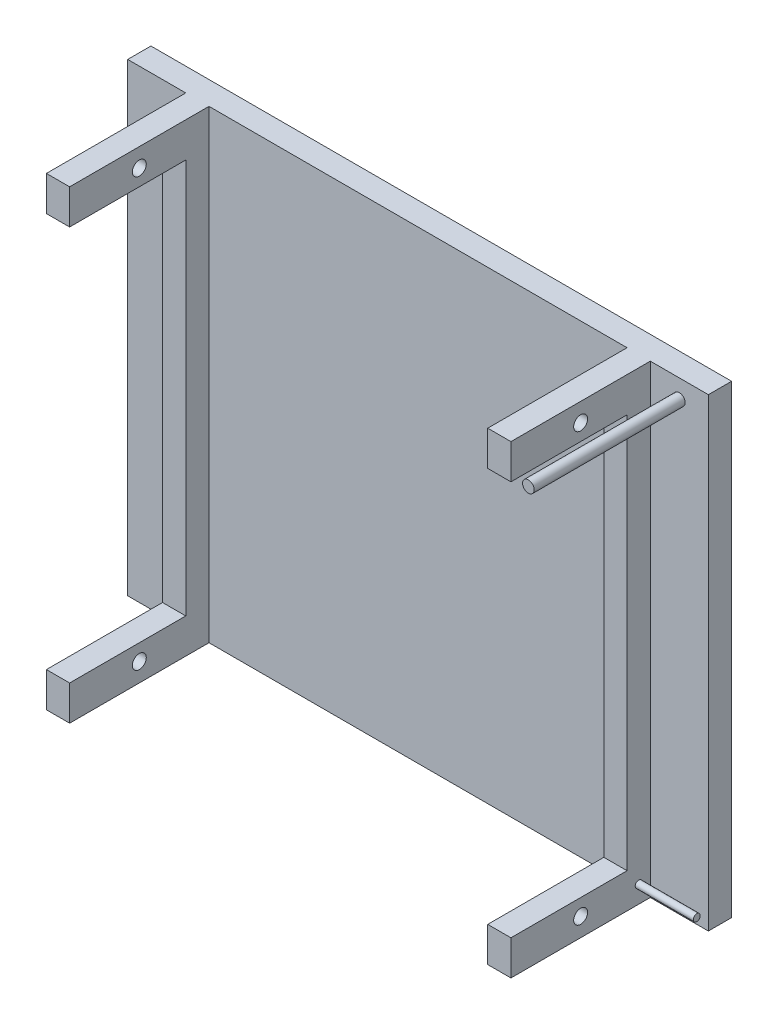
ISO-10303-21;
HEADER;
FILE_DESCRIPTION(('STEP AP214'),'2;1');
FILE_NAME('part.step','',(''),(''),'','','');
FILE_SCHEMA(('AUTOMOTIVE_DESIGN { 1 0 10303 214 1 1 1 1 }'));
ENDSEC;
DATA;
#1=APPLICATION_CONTEXT('core data for automotive mechanical design processes');
#2=APPLICATION_PROTOCOL_DEFINITION('international standard','automotive_design',2000,#1);
#3=PRODUCT_CONTEXT('',#1,'mechanical');
#4=PRODUCT('Part','Part','',(#3));
#5=PRODUCT_RELATED_PRODUCT_CATEGORY('part','',(#4));
#6=PRODUCT_DEFINITION_FORMATION('','',#4);
#7=PRODUCT_DEFINITION_CONTEXT('part definition',#1,'design');
#8=PRODUCT_DEFINITION('design','',#6,#7);
#9=PRODUCT_DEFINITION_SHAPE('','',#8);
#10=(LENGTH_UNIT() NAMED_UNIT(*) SI_UNIT(.MILLI.,.METRE.));
#11=(NAMED_UNIT(*) PLANE_ANGLE_UNIT() SI_UNIT($,.RADIAN.));
#12=(NAMED_UNIT(*) SI_UNIT($,.STERADIAN.) SOLID_ANGLE_UNIT());
#13=UNCERTAINTY_MEASURE_WITH_UNIT(LENGTH_MEASURE(1.E-05),#10,'distance_accuracy_value','');
#14=(GEOMETRIC_REPRESENTATION_CONTEXT(3) GLOBAL_UNCERTAINTY_ASSIGNED_CONTEXT((#13)) GLOBAL_UNIT_ASSIGNED_CONTEXT((#10,
#11,#12)) REPRESENTATION_CONTEXT('',''));
#15=CARTESIAN_POINT('',(0.,0.,0.));
#16=DIRECTION('',(0.,0.,1.));
#17=DIRECTION('',(1.,0.,0.));
#18=AXIS2_PLACEMENT_3D('',#15,#16,#17);
#19=CARTESIAN_POINT('',(0.,0.,70.));
#20=DIRECTION('',(0.,0.,1.));
#21=DIRECTION('',(1.,0.,0.));
#22=AXIS2_PLACEMENT_3D('',#19,#20,#21);
#23=PLANE('',#22);
#24=DIRECTION('',(1.,0.,0.));
#25=VECTOR('',#24,1.);
#26=CARTESIAN_POINT('',(0.,-14.9999999999999,70.));
#27=LINE('',#26,#25);
#28=CARTESIAN_POINT('',(25.,-14.9999999999999,70.));
#29=VERTEX_POINT('',#28);
#30=CARTESIAN_POINT('',(35.,-14.9999999999999,70.));
#31=VERTEX_POINT('',#30);
#32=EDGE_CURVE('E335',#29,#31,#27,.T.);
#33=ORIENTED_EDGE('',*,*,#32,.T.);
#34=DIRECTION('',(0.,1.,0.));
#35=VECTOR('',#34,1.);
#36=CARTESIAN_POINT('',(35.,0.,70.));
#37=LINE('',#36,#35);
#38=CARTESIAN_POINT('',(35.,0.,70.));
#39=VERTEX_POINT('',#38);
#40=EDGE_CURVE('E238',#31,#39,#37,.T.);
#41=ORIENTED_EDGE('',*,*,#40,.T.);
#42=DIRECTION('',(-1.,0.,0.));
#43=VECTOR('',#42,1.);
#44=CARTESIAN_POINT('',(25.,0.,70.));
#45=LINE('',#44,#43);
#46=CARTESIAN_POINT('',(25.,0.,70.));
#47=VERTEX_POINT('',#46);
#48=EDGE_CURVE('E242',#39,#47,#45,.T.);
#49=ORIENTED_EDGE('',*,*,#48,.T.);
#50=DIRECTION('',(0.,-1.,0.));
#51=VECTOR('',#50,1.);
#52=CARTESIAN_POINT('',(25.,0.,70.));
#53=LINE('',#52,#51);
#54=EDGE_CURVE('E232',#47,#29,#53,.T.);
#55=ORIENTED_EDGE('',*,*,#54,.T.);
#56=EDGE_LOOP('',(#33,#41,#49,#55));
#57=FACE_BOUND('',#56,.T.);
#58=ADVANCED_FACE('F38',(#57),#23,.T.);
#59=CARTESIAN_POINT('',(0.,0.,70.));
#60=DIRECTION('',(0.,0.,-1.));
#61=DIRECTION('',(-1.,0.,0.));
#62=AXIS2_PLACEMENT_3D('',#59,#60,#61);
#63=PLANE('',#62);
#64=DIRECTION('',(0.,-1.,0.));
#65=VECTOR('',#64,1.);
#66=CARTESIAN_POINT('',(215.,0.,70.));
#67=LINE('',#66,#65);
#68=CARTESIAN_POINT('',(215.,0.,70.));
#69=VERTEX_POINT('',#68);
#70=CARTESIAN_POINT('',(215.,-14.9999999999999,70.));
#71=VERTEX_POINT('',#70);
#72=EDGE_CURVE('E211',#69,#71,#67,.T.);
#73=ORIENTED_EDGE('',*,*,#72,.T.);
#74=DIRECTION('',(1.,0.,0.));
#75=VECTOR('',#74,1.);
#76=CARTESIAN_POINT('',(0.,-14.9999999999999,70.));
#77=LINE('',#76,#75);
#78=CARTESIAN_POINT('',(225.,-14.9999999999999,70.));
#79=VERTEX_POINT('',#78);
#80=EDGE_CURVE('E183',#71,#79,#77,.T.);
#81=ORIENTED_EDGE('',*,*,#80,.T.);
#82=DIRECTION('',(0.,1.,0.));
#83=VECTOR('',#82,1.);
#84=CARTESIAN_POINT('',(225.,0.,70.));
#85=LINE('',#84,#83);
#86=CARTESIAN_POINT('',(225.,0.,70.));
#87=VERTEX_POINT('',#86);
#88=EDGE_CURVE('E202',#79,#87,#85,.T.);
#89=ORIENTED_EDGE('',*,*,#88,.T.);
#90=DIRECTION('',(-1.,0.,0.));
#91=VECTOR('',#90,1.);
#92=CARTESIAN_POINT('',(225.,0.,70.));
#93=LINE('',#92,#91);
#94=EDGE_CURVE('E201',#87,#69,#93,.T.);
#95=ORIENTED_EDGE('',*,*,#94,.T.);
#96=EDGE_LOOP('',(#73,#81,#89,#95));
#97=FACE_BOUND('',#96,.T.);
#98=ADVANCED_FACE('F400',(#97),#63,.F.);
#99=CARTESIAN_POINT('',(0.,0.,10.));
#100=DIRECTION('',(0.,0.,1.));
#101=DIRECTION('',(1.,0.,0.));
#102=AXIS2_PLACEMENT_3D('',#99,#100,#101);
#103=PLANE('',#102);
#104=CARTESIAN_POINT('',(237.5,-8.00000000000001,10.));
#105=DIRECTION('',(0.,0.,1.));
#106=DIRECTION('',(1.,0.,0.));
#107=AXIS2_PLACEMENT_3D('',#104,#105,#106);
#108=CIRCLE('',#107,2.5);
#109=CARTESIAN_POINT('',(240.,-8.00000000000001,10.));
#110=VERTEX_POINT('',#109);
#111=EDGE_CURVE('E355',#110,#110,#108,.T.);
#112=ORIENTED_EDGE('',*,*,#111,.F.);
#113=EDGE_LOOP('',(#112));
#114=FACE_BOUND('',#113,.T.);
#115=DIRECTION('',(-1.,0.,0.));
#116=VECTOR('',#115,1.);
#117=CARTESIAN_POINT('',(0.,0.,10.));
#118=LINE('',#117,#116);
#119=CARTESIAN_POINT('',(250.,0.,10.));
#120=VERTEX_POINT('',#119);
#121=CARTESIAN_POINT('',(225.,0.,10.));
#122=VERTEX_POINT('',#121);
#123=EDGE_CURVE('E273',#120,#122,#118,.T.);
#124=ORIENTED_EDGE('',*,*,#123,.T.);
#125=DIRECTION('',(0.,1.,0.));
#126=VECTOR('',#125,1.);
#127=CARTESIAN_POINT('',(225.,0.,10.));
#128=LINE('',#127,#126);
#129=CARTESIAN_POINT('',(225.,-200.,10.));
#130=VERTEX_POINT('',#129);
#131=EDGE_CURVE('E216',#130,#122,#128,.T.);
#132=ORIENTED_EDGE('',*,*,#131,.F.);
#133=DIRECTION('',(1.,0.,0.));
#134=VECTOR('',#133,1.);
#135=CARTESIAN_POINT('',(0.,-200.,10.));
#136=LINE('',#135,#134);
#137=CARTESIAN_POINT('',(250.,-200.,10.));
#138=VERTEX_POINT('',#137);
#139=EDGE_CURVE('E265',#130,#138,#136,.T.);
#140=ORIENTED_EDGE('',*,*,#139,.T.);
#141=DIRECTION('',(0.,1.,0.));
#142=VECTOR('',#141,1.);
#143=CARTESIAN_POINT('',(250.,0.,10.));
#144=LINE('',#143,#142);
#145=EDGE_CURVE('E269',#138,#120,#144,.T.);
#146=ORIENTED_EDGE('',*,*,#145,.T.);
#147=EDGE_LOOP('',(#124,#132,#140,#146));
#148=FACE_BOUND('',#147,.T.);
#149=ADVANCED_FACE('F418',(#114,#148),#103,.T.);
#150=CARTESIAN_POINT('',(35.,-200.,10.));
#151=VERTEX_POINT('',#150);
#152=CARTESIAN_POINT('',(215.,-200.,10.));
#153=VERTEX_POINT('',#152);
#154=EDGE_CURVE('E270',#151,#153,#136,.T.);
#155=ORIENTED_EDGE('',*,*,#154,.T.);
#156=DIRECTION('',(0.,-1.,0.));
#157=VECTOR('',#156,1.);
#158=CARTESIAN_POINT('',(215.,0.,10.));
#159=LINE('',#158,#157);
#160=CARTESIAN_POINT('',(215.,0.,10.));
#161=VERTEX_POINT('',#160);
#162=EDGE_CURVE('E206',#161,#153,#159,.T.);
#163=ORIENTED_EDGE('',*,*,#162,.F.);
#164=CARTESIAN_POINT('',(35.,0.,10.));
#165=VERTEX_POINT('',#164);
#166=EDGE_CURVE('E276',#161,#165,#118,.T.);
#167=ORIENTED_EDGE('',*,*,#166,.T.);
#168=DIRECTION('',(0.,1.,0.));
#169=VECTOR('',#168,1.);
#170=CARTESIAN_POINT('',(35.,0.,10.));
#171=LINE('',#170,#169);
#172=EDGE_CURVE('E247',#151,#165,#171,.T.);
#173=ORIENTED_EDGE('',*,*,#172,.F.);
#174=EDGE_LOOP('',(#155,#163,#167,#173));
#175=FACE_BOUND('',#174,.T.);
#176=ADVANCED_FACE('F445',(#175),#103,.T.);
#177=DIRECTION('',(0.,-1.,0.));
#178=VECTOR('',#177,1.);
#179=CARTESIAN_POINT('',(25.,0.,10.));
#180=LINE('',#179,#178);
#181=CARTESIAN_POINT('',(25.,0.,10.));
#182=VERTEX_POINT('',#181);
#183=CARTESIAN_POINT('',(25.,-200.,10.));
#184=VERTEX_POINT('',#183);
#185=EDGE_CURVE('E231',#182,#184,#180,.T.);
#186=ORIENTED_EDGE('',*,*,#185,.F.);
#187=CARTESIAN_POINT('',(0.,0.,10.));
#188=VERTEX_POINT('',#187);
#189=EDGE_CURVE('E272',#182,#188,#118,.T.);
#190=ORIENTED_EDGE('',*,*,#189,.T.);
#191=DIRECTION('',(0.,-1.,0.));
#192=VECTOR('',#191,1.);
#193=CARTESIAN_POINT('',(0.,0.,10.));
#194=LINE('',#193,#192);
#195=CARTESIAN_POINT('',(0.,-200.,10.));
#196=VERTEX_POINT('',#195);
#197=EDGE_CURVE('E262',#188,#196,#194,.T.);
#198=ORIENTED_EDGE('',*,*,#197,.T.);
#199=EDGE_CURVE('E267',#196,#184,#136,.T.);
#200=ORIENTED_EDGE('',*,*,#199,.T.);
#201=EDGE_LOOP('',(#186,#190,#198,#200));
#202=FACE_BOUND('',#201,.T.);
#203=ADVANCED_FACE('F447',(#202),#103,.T.);
#204=CARTESIAN_POINT('',(0.,0.,10.));
#205=DIRECTION('',(1.,0.,0.));
#206=DIRECTION('',(0.,1.,0.));
#207=AXIS2_PLACEMENT_3D('',#204,#205,#206);
#208=PLANE('',#207);
#209=DIRECTION('',(0.,-1.,0.));
#210=VECTOR('',#209,1.);
#211=CARTESIAN_POINT('',(0.,0.,0.));
#212=LINE('',#211,#210);
#213=CARTESIAN_POINT('',(0.,0.,0.));
#214=VERTEX_POINT('',#213);
#215=CARTESIAN_POINT('',(0.,-200.,0.));
#216=VERTEX_POINT('',#215);
#217=EDGE_CURVE('E261',#214,#216,#212,.T.);
#218=ORIENTED_EDGE('',*,*,#217,.T.);
#219=DIRECTION('',(0.,0.,-1.));
#220=VECTOR('',#219,1.);
#221=CARTESIAN_POINT('',(0.,-200.,10.));
#222=LINE('',#221,#220);
#223=EDGE_CURVE('E184',#196,#216,#222,.T.);
#224=ORIENTED_EDGE('',*,*,#223,.F.);
#225=ORIENTED_EDGE('',*,*,#197,.F.);
#226=DIRECTION('',(0.,0.,-1.));
#227=VECTOR('',#226,1.);
#228=CARTESIAN_POINT('',(0.,0.,10.));
#229=LINE('',#228,#227);
#230=EDGE_CURVE('E275',#188,#214,#229,.T.);
#231=ORIENTED_EDGE('',*,*,#230,.T.);
#232=EDGE_LOOP('',(#218,#224,#225,#231));
#233=FACE_BOUND('',#232,.T.);
#234=ADVANCED_FACE('F40',(#233),#208,.F.);
#235=CARTESIAN_POINT('',(0.,-200.,10.));
#236=DIRECTION('',(0.,1.,0.));
#237=DIRECTION('',(0.,0.,1.));
#238=AXIS2_PLACEMENT_3D('',#235,#236,#237);
#239=PLANE('',#238);
#240=DIRECTION('',(1.,0.,0.));
#241=VECTOR('',#240,1.);
#242=CARTESIAN_POINT('',(0.,-200.,0.));
#243=LINE('',#242,#241);
#244=CARTESIAN_POINT('',(250.,-200.,0.));
#245=VERTEX_POINT('',#244);
#246=EDGE_CURVE('E279',#216,#245,#243,.T.);
#247=ORIENTED_EDGE('',*,*,#246,.T.);
#248=DIRECTION('',(0.,0.,-1.));
#249=VECTOR('',#248,1.);
#250=CARTESIAN_POINT('',(250.,-200.,10.));
#251=LINE('',#250,#249);
#252=EDGE_CURVE('E289',#138,#245,#251,.T.);
#253=ORIENTED_EDGE('',*,*,#252,.F.);
#254=ORIENTED_EDGE('',*,*,#139,.F.);
#255=DIRECTION('',(0.,0.,-1.));
#256=VECTOR('',#255,1.);
#257=CARTESIAN_POINT('',(225.,-200.,70.));
#258=LINE('',#257,#256);
#259=CARTESIAN_POINT('',(225.,-200.,70.));
#260=VERTEX_POINT('',#259);
#261=EDGE_CURVE('E215',#260,#130,#258,.T.);
#262=ORIENTED_EDGE('',*,*,#261,.F.);
#263=DIRECTION('',(1.,0.,0.));
#264=VECTOR('',#263,1.);
#265=CARTESIAN_POINT('',(225.,-200.,70.));
#266=LINE('',#265,#264);
#267=CARTESIAN_POINT('',(215.,-200.,70.));
#268=VERTEX_POINT('',#267);
#269=EDGE_CURVE('E199',#268,#260,#266,.T.);
#270=ORIENTED_EDGE('',*,*,#269,.F.);
#271=DIRECTION('',(0.,0.,-1.));
#272=VECTOR('',#271,1.);
#273=CARTESIAN_POINT('',(215.,-200.,70.));
#274=LINE('',#273,#272);
#275=EDGE_CURVE('E222',#268,#153,#274,.T.);
#276=ORIENTED_EDGE('',*,*,#275,.T.);
#277=ORIENTED_EDGE('',*,*,#154,.F.);
#278=DIRECTION('',(0.,0.,-1.));
#279=VECTOR('',#278,1.);
#280=CARTESIAN_POINT('',(35.,-200.,70.));
#281=LINE('',#280,#279);
#282=CARTESIAN_POINT('',(35.,-200.,70.));
#283=VERTEX_POINT('',#282);
#284=EDGE_CURVE('E255',#283,#151,#281,.T.);
#285=ORIENTED_EDGE('',*,*,#284,.F.);
#286=DIRECTION('',(1.,0.,0.));
#287=VECTOR('',#286,1.);
#288=CARTESIAN_POINT('',(25.,-200.,70.));
#289=LINE('',#288,#287);
#290=CARTESIAN_POINT('',(25.,-200.,70.));
#291=VERTEX_POINT('',#290);
#292=EDGE_CURVE('E235',#291,#283,#289,.T.);
#293=ORIENTED_EDGE('',*,*,#292,.F.);
#294=DIRECTION('',(0.,0.,-1.));
#295=VECTOR('',#294,1.);
#296=CARTESIAN_POINT('',(25.,-200.,70.));
#297=LINE('',#296,#295);
#298=EDGE_CURVE('E258',#291,#184,#297,.T.);
#299=ORIENTED_EDGE('',*,*,#298,.T.);
#300=ORIENTED_EDGE('',*,*,#199,.F.);
#301=ORIENTED_EDGE('',*,*,#223,.T.);
#302=EDGE_LOOP('',(#247,#253,#254,#262,#270,#276,#277,#285,#293,#299,#300,#301));
#303=FACE_BOUND('',#302,.T.);
#304=ADVANCED_FACE('F413',(#303),#239,.F.);
#305=CARTESIAN_POINT('',(250.,0.,10.));
#306=DIRECTION('',(-1.,0.,0.));
#307=DIRECTION('',(0.,-1.,0.));
#308=AXIS2_PLACEMENT_3D('',#305,#306,#307);
#309=PLANE('',#308);
#310=DIRECTION('',(0.,1.,0.));
#311=VECTOR('',#310,1.);
#312=CARTESIAN_POINT('',(250.,0.,0.));
#313=LINE('',#312,#311);
#314=CARTESIAN_POINT('',(250.,0.,0.));
#315=VERTEX_POINT('',#314);
#316=EDGE_CURVE('E281',#245,#315,#313,.T.);
#317=ORIENTED_EDGE('',*,*,#316,.T.);
#318=DIRECTION('',(0.,0.,-1.));
#319=VECTOR('',#318,1.);
#320=CARTESIAN_POINT('',(250.,0.,10.));
#321=LINE('',#320,#319);
#322=EDGE_CURVE('E286',#120,#315,#321,.T.);
#323=ORIENTED_EDGE('',*,*,#322,.F.);
#324=ORIENTED_EDGE('',*,*,#145,.F.);
#325=ORIENTED_EDGE('',*,*,#252,.T.);
#326=EDGE_LOOP('',(#317,#323,#324,#325));
#327=FACE_BOUND('',#326,.T.);
#328=ADVANCED_FACE('F421',(#327),#309,.F.);
#329=CARTESIAN_POINT('',(0.,0.,10.));
#330=DIRECTION('',(0.,-1.,0.));
#331=DIRECTION('',(0.,0.,-1.));
#332=AXIS2_PLACEMENT_3D('',#329,#330,#331);
#333=PLANE('',#332);
#334=DIRECTION('',(-1.,0.,0.));
#335=VECTOR('',#334,1.);
#336=CARTESIAN_POINT('',(0.,0.,0.));
#337=LINE('',#336,#335);
#338=EDGE_CURVE('E266',#315,#214,#337,.T.);
#339=ORIENTED_EDGE('',*,*,#338,.T.);
#340=ORIENTED_EDGE('',*,*,#230,.F.);
#341=ORIENTED_EDGE('',*,*,#189,.F.);
#342=DIRECTION('',(0.,0.,-1.));
#343=VECTOR('',#342,1.);
#344=CARTESIAN_POINT('',(25.,0.,70.));
#345=LINE('',#344,#343);
#346=EDGE_CURVE('E244',#47,#182,#345,.T.);
#347=ORIENTED_EDGE('',*,*,#346,.F.);
#348=ORIENTED_EDGE('',*,*,#48,.F.);
#349=DIRECTION('',(0.,0.,-1.));
#350=VECTOR('',#349,1.);
#351=CARTESIAN_POINT('',(35.,0.,70.));
#352=LINE('',#351,#350);
#353=EDGE_CURVE('E252',#39,#165,#352,.T.);
#354=ORIENTED_EDGE('',*,*,#353,.T.);
#355=ORIENTED_EDGE('',*,*,#166,.F.);
#356=DIRECTION('',(0.,0.,-1.));
#357=VECTOR('',#356,1.);
#358=CARTESIAN_POINT('',(215.,0.,70.));
#359=LINE('',#358,#357);
#360=EDGE_CURVE('E225',#69,#161,#359,.T.);
#361=ORIENTED_EDGE('',*,*,#360,.F.);
#362=ORIENTED_EDGE('',*,*,#94,.F.);
#363=DIRECTION('',(0.,0.,-1.));
#364=VECTOR('',#363,1.);
#365=CARTESIAN_POINT('',(225.,0.,70.));
#366=LINE('',#365,#364);
#367=EDGE_CURVE('E228',#87,#122,#366,.T.);
#368=ORIENTED_EDGE('',*,*,#367,.T.);
#369=ORIENTED_EDGE('',*,*,#123,.F.);
#370=ORIENTED_EDGE('',*,*,#322,.T.);
#371=EDGE_LOOP('',(#339,#340,#341,#347,#348,#354,#355,#361,#362,#368,#369,#370));
#372=FACE_BOUND('',#371,.T.);
#373=ADVANCED_FACE('F406',(#372),#333,.F.);
#374=CARTESIAN_POINT('',(0.,0.,0.));
#375=DIRECTION('',(0.,0.,1.));
#376=DIRECTION('',(1.,0.,0.));
#377=AXIS2_PLACEMENT_3D('',#374,#375,#376);
#378=PLANE('',#377);
#379=ORIENTED_EDGE('',*,*,#217,.F.);
#380=ORIENTED_EDGE('',*,*,#338,.F.);
#381=ORIENTED_EDGE('',*,*,#316,.F.);
#382=ORIENTED_EDGE('',*,*,#246,.F.);
#383=EDGE_LOOP('',(#379,#380,#381,#382));
#384=FACE_BOUND('',#383,.T.);
#385=ADVANCED_FACE('F427',(#384),#378,.F.);
#386=CARTESIAN_POINT('',(25.,0.,70.));
#387=DIRECTION('',(1.,0.,0.));
#388=DIRECTION('',(0.,1.,0.));
#389=AXIS2_PLACEMENT_3D('',#386,#387,#388);
#390=PLANE('',#389);
#391=CARTESIAN_POINT('',(25.,-7.99999999999994,40.));
#392=DIRECTION('',(1.,0.,0.));
#393=DIRECTION('',(0.,1.,0.));
#394=AXIS2_PLACEMENT_3D('',#391,#392,#393);
#395=CIRCLE('',#394,3.);
#396=CARTESIAN_POINT('',(25.,-4.99999999999994,40.));
#397=VERTEX_POINT('',#396);
#398=EDGE_CURVE('E208',#397,#397,#395,.T.);
#399=ORIENTED_EDGE('',*,*,#398,.T.);
#400=EDGE_LOOP('',(#399));
#401=FACE_BOUND('',#400,.T.);
#402=CARTESIAN_POINT('',(25.,-192.,40.));
#403=DIRECTION('',(1.,0.,0.));
#404=DIRECTION('',(0.,1.,0.));
#405=AXIS2_PLACEMENT_3D('',#402,#403,#404);
#406=CIRCLE('',#405,3.);
#407=CARTESIAN_POINT('',(25.,-189.,40.));
#408=VERTEX_POINT('',#407);
#409=EDGE_CURVE('E305',#408,#408,#406,.T.);
#410=ORIENTED_EDGE('',*,*,#409,.T.);
#411=EDGE_LOOP('',(#410));
#412=FACE_BOUND('',#411,.T.);
#413=DIRECTION('',(0.,1.,0.));
#414=VECTOR('',#413,1.);
#415=CARTESIAN_POINT('',(25.,0.,20.));
#416=LINE('',#415,#414);
#417=CARTESIAN_POINT('',(25.,-185.,20.));
#418=VERTEX_POINT('',#417);
#419=CARTESIAN_POINT('',(25.,-14.9999999999999,20.));
#420=VERTEX_POINT('',#419);
#421=EDGE_CURVE('E301',#418,#420,#416,.T.);
#422=ORIENTED_EDGE('',*,*,#421,.T.);
#423=DIRECTION('',(0.,0.,1.));
#424=VECTOR('',#423,1.);
#425=CARTESIAN_POINT('',(25.,-14.9999999999999,70.));
#426=LINE('',#425,#424);
#427=EDGE_CURVE('E321',#420,#29,#426,.T.);
#428=ORIENTED_EDGE('',*,*,#427,.T.);
#429=ORIENTED_EDGE('',*,*,#54,.F.);
#430=ORIENTED_EDGE('',*,*,#346,.T.);
#431=ORIENTED_EDGE('',*,*,#185,.T.);
#432=ORIENTED_EDGE('',*,*,#298,.F.);
#433=CARTESIAN_POINT('',(25.,-185.,70.));
#434=VERTEX_POINT('',#433);
#435=EDGE_CURVE('E236',#434,#291,#53,.T.);
#436=ORIENTED_EDGE('',*,*,#435,.F.);
#437=DIRECTION('',(0.,0.,-1.));
#438=VECTOR('',#437,1.);
#439=CARTESIAN_POINT('',(25.,-185.,70.));
#440=LINE('',#439,#438);
#441=EDGE_CURVE('E53',#434,#418,#440,.T.);
#442=ORIENTED_EDGE('',*,*,#441,.T.);
#443=EDGE_LOOP('',(#422,#428,#429,#430,#431,#432,#436,#442));
#444=FACE_BOUND('',#443,.T.);
#445=ADVANCED_FACE('F437',(#401,#412,#444),#390,.F.);
#446=CARTESIAN_POINT('',(35.,0.,70.));
#447=DIRECTION('',(-1.,0.,0.));
#448=DIRECTION('',(0.,-1.,0.));
#449=AXIS2_PLACEMENT_3D('',#446,#447,#448);
#450=PLANE('',#449);
#451=CARTESIAN_POINT('',(35.,-7.99999999999994,40.));
#452=DIRECTION('',(-1.,0.,0.));
#453=DIRECTION('',(0.,-1.,0.));
#454=AXIS2_PLACEMENT_3D('',#451,#452,#453);
#455=CIRCLE('',#454,3.);
#456=CARTESIAN_POINT('',(35.,-10.9999999999999,40.));
#457=VERTEX_POINT('',#456);
#458=EDGE_CURVE('E304',#457,#457,#455,.T.);
#459=ORIENTED_EDGE('',*,*,#458,.T.);
#460=EDGE_LOOP('',(#459));
#461=FACE_BOUND('',#460,.T.);
#462=CARTESIAN_POINT('',(35.,-192.,40.));
#463=DIRECTION('',(-1.,0.,0.));
#464=DIRECTION('',(0.,-1.,0.));
#465=AXIS2_PLACEMENT_3D('',#462,#463,#464);
#466=CIRCLE('',#465,3.);
#467=CARTESIAN_POINT('',(35.,-195.,40.));
#468=VERTEX_POINT('',#467);
#469=EDGE_CURVE('E300',#468,#468,#466,.T.);
#470=ORIENTED_EDGE('',*,*,#469,.T.);
#471=EDGE_LOOP('',(#470));
#472=FACE_BOUND('',#471,.T.);
#473=ORIENTED_EDGE('',*,*,#40,.F.);
#474=DIRECTION('',(0.,0.,-1.));
#475=VECTOR('',#474,1.);
#476=CARTESIAN_POINT('',(35.,-14.9999999999999,70.));
#477=LINE('',#476,#475);
#478=CARTESIAN_POINT('',(35.,-14.9999999999999,20.));
#479=VERTEX_POINT('',#478);
#480=EDGE_CURVE('E324',#31,#479,#477,.T.);
#481=ORIENTED_EDGE('',*,*,#480,.T.);
#482=DIRECTION('',(0.,-1.,0.));
#483=VECTOR('',#482,1.);
#484=CARTESIAN_POINT('',(35.,0.,20.));
#485=LINE('',#484,#483);
#486=CARTESIAN_POINT('',(35.,-185.,20.));
#487=VERTEX_POINT('',#486);
#488=EDGE_CURVE('E318',#479,#487,#485,.T.);
#489=ORIENTED_EDGE('',*,*,#488,.T.);
#490=DIRECTION('',(0.,0.,1.));
#491=VECTOR('',#490,1.);
#492=CARTESIAN_POINT('',(35.,-185.,70.));
#493=LINE('',#492,#491);
#494=CARTESIAN_POINT('',(35.,-185.,70.));
#495=VERTEX_POINT('',#494);
#496=EDGE_CURVE('E331',#487,#495,#493,.T.);
#497=ORIENTED_EDGE('',*,*,#496,.T.);
#498=EDGE_CURVE('E239',#283,#495,#37,.T.);
#499=ORIENTED_EDGE('',*,*,#498,.F.);
#500=ORIENTED_EDGE('',*,*,#284,.T.);
#501=ORIENTED_EDGE('',*,*,#172,.T.);
#502=ORIENTED_EDGE('',*,*,#353,.F.);
#503=EDGE_LOOP('',(#473,#481,#489,#497,#499,#500,#501,#502));
#504=FACE_BOUND('',#503,.T.);
#505=ADVANCED_FACE('F443',(#461,#472,#504),#450,.F.);
#506=DIRECTION('',(1.,0.,0.));
#507=VECTOR('',#506,1.);
#508=CARTESIAN_POINT('',(0.,-185.,70.));
#509=LINE('',#508,#507);
#510=EDGE_CURVE('E336',#434,#495,#509,.T.);
#511=ORIENTED_EDGE('',*,*,#510,.F.);
#512=ORIENTED_EDGE('',*,*,#435,.T.);
#513=ORIENTED_EDGE('',*,*,#292,.T.);
#514=ORIENTED_EDGE('',*,*,#498,.T.);
#515=EDGE_LOOP('',(#511,#512,#513,#514));
#516=FACE_BOUND('',#515,.T.);
#517=ADVANCED_FACE('F376',(#516),#23,.T.);
#518=CARTESIAN_POINT('',(225.,0.,70.));
#519=DIRECTION('',(-1.,0.,0.));
#520=DIRECTION('',(0.,-1.,0.));
#521=AXIS2_PLACEMENT_3D('',#518,#519,#520);
#522=PLANE('',#521);
#523=CARTESIAN_POINT('',(225.,-192.5,15.));
#524=DIRECTION('',(-1.,0.,0.));
#525=DIRECTION('',(0.,-1.,0.));
#526=AXIS2_PLACEMENT_3D('',#523,#524,#525);
#527=CIRCLE('',#526,1.5);
#528=CARTESIAN_POINT('',(225.,-194.,15.));
#529=VERTEX_POINT('',#528);
#530=EDGE_CURVE('E11',#529,#529,#527,.F.);
#531=ORIENTED_EDGE('',*,*,#530,.F.);
#532=EDGE_LOOP('',(#531));
#533=FACE_BOUND('',#532,.T.);
#534=CARTESIAN_POINT('',(225.,-7.99999999999994,40.));
#535=DIRECTION('',(1.,0.,0.));
#536=DIRECTION('',(0.,0.,-1.));
#537=AXIS2_PLACEMENT_3D('',#534,#535,#536);
#538=CIRCLE('',#537,3.);
#539=CARTESIAN_POINT('',(225.,-7.99999999999994,37.));
#540=VERTEX_POINT('',#539);
#541=EDGE_CURVE('E349',#540,#540,#538,.T.);
#542=ORIENTED_EDGE('',*,*,#541,.F.);
#543=EDGE_LOOP('',(#542));
#544=FACE_BOUND('',#543,.T.);
#545=CARTESIAN_POINT('',(225.,-192.,40.));
#546=DIRECTION('',(1.,0.,0.));
#547=DIRECTION('',(0.,0.,-1.));
#548=AXIS2_PLACEMENT_3D('',#545,#546,#547);
#549=CIRCLE('',#548,3.);
#550=CARTESIAN_POINT('',(225.,-192.,37.));
#551=VERTEX_POINT('',#550);
#552=EDGE_CURVE('E195',#551,#551,#549,.T.);
#553=ORIENTED_EDGE('',*,*,#552,.F.);
#554=EDGE_LOOP('',(#553));
#555=FACE_BOUND('',#554,.T.);
#556=ORIENTED_EDGE('',*,*,#88,.F.);
#557=DIRECTION('',(0.,0.,1.));
#558=VECTOR('',#557,1.);
#559=CARTESIAN_POINT('',(225.,-14.9999999999999,70.));
#560=LINE('',#559,#558);
#561=CARTESIAN_POINT('',(225.,-14.9999999999999,20.));
#562=VERTEX_POINT('',#561);
#563=EDGE_CURVE('E339',#562,#79,#560,.T.);
#564=ORIENTED_EDGE('',*,*,#563,.F.);
#565=DIRECTION('',(0.,1.,0.));
#566=VECTOR('',#565,1.);
#567=CARTESIAN_POINT('',(225.,-14.9999999999999,20.));
#568=LINE('',#567,#566);
#569=CARTESIAN_POINT('',(225.,-185.,20.));
#570=VERTEX_POINT('',#569);
#571=EDGE_CURVE('E194',#570,#562,#568,.T.);
#572=ORIENTED_EDGE('',*,*,#571,.F.);
#573=DIRECTION('',(0.,0.,-1.));
#574=VECTOR('',#573,1.);
#575=CARTESIAN_POINT('',(225.,-185.,70.));
#576=LINE('',#575,#574);
#577=CARTESIAN_POINT('',(225.,-185.,70.));
#578=VERTEX_POINT('',#577);
#579=EDGE_CURVE('E178',#578,#570,#576,.T.);
#580=ORIENTED_EDGE('',*,*,#579,.F.);
#581=EDGE_CURVE('E191',#260,#578,#85,.T.);
#582=ORIENTED_EDGE('',*,*,#581,.F.);
#583=ORIENTED_EDGE('',*,*,#261,.T.);
#584=ORIENTED_EDGE('',*,*,#131,.T.);
#585=ORIENTED_EDGE('',*,*,#367,.F.);
#586=EDGE_LOOP('',(#556,#564,#572,#580,#582,#583,#584,#585));
#587=FACE_BOUND('',#586,.T.);
#588=ADVANCED_FACE('F189',(#533,#544,#555,#587),#522,.F.);
#589=CARTESIAN_POINT('',(215.,0.,70.));
#590=DIRECTION('',(1.,0.,0.));
#591=DIRECTION('',(0.,1.,0.));
#592=AXIS2_PLACEMENT_3D('',#589,#590,#591);
#593=PLANE('',#592);
#594=CARTESIAN_POINT('',(215.,-7.99999999999994,40.));
#595=DIRECTION('',(1.,0.,0.));
#596=DIRECTION('',(0.,1.,0.));
#597=AXIS2_PLACEMENT_3D('',#594,#595,#596);
#598=CIRCLE('',#597,3.);
#599=CARTESIAN_POINT('',(215.,-4.99999999999994,40.));
#600=VERTEX_POINT('',#599);
#601=EDGE_CURVE('E302',#600,#600,#598,.T.);
#602=ORIENTED_EDGE('',*,*,#601,.T.);
#603=EDGE_LOOP('',(#602));
#604=FACE_BOUND('',#603,.T.);
#605=CARTESIAN_POINT('',(215.,-192.,40.));
#606=DIRECTION('',(1.,0.,0.));
#607=DIRECTION('',(0.,1.,0.));
#608=AXIS2_PLACEMENT_3D('',#605,#606,#607);
#609=CIRCLE('',#608,3.);
#610=CARTESIAN_POINT('',(215.,-189.,40.));
#611=VERTEX_POINT('',#610);
#612=EDGE_CURVE('E298',#611,#611,#609,.T.);
#613=ORIENTED_EDGE('',*,*,#612,.T.);
#614=EDGE_LOOP('',(#613));
#615=FACE_BOUND('',#614,.T.);
#616=DIRECTION('',(0.,1.,0.));
#617=VECTOR('',#616,1.);
#618=CARTESIAN_POINT('',(215.,0.,20.));
#619=LINE('',#618,#617);
#620=CARTESIAN_POINT('',(215.,-185.,20.));
#621=VERTEX_POINT('',#620);
#622=CARTESIAN_POINT('',(215.,-14.9999999999999,20.));
#623=VERTEX_POINT('',#622);
#624=EDGE_CURVE('E46',#621,#623,#619,.T.);
#625=ORIENTED_EDGE('',*,*,#624,.T.);
#626=DIRECTION('',(0.,0.,1.));
#627=VECTOR('',#626,1.);
#628=CARTESIAN_POINT('',(215.,-14.9999999999999,70.));
#629=LINE('',#628,#627);
#630=EDGE_CURVE('E327',#623,#71,#629,.T.);
#631=ORIENTED_EDGE('',*,*,#630,.T.);
#632=ORIENTED_EDGE('',*,*,#72,.F.);
#633=ORIENTED_EDGE('',*,*,#360,.T.);
#634=ORIENTED_EDGE('',*,*,#162,.T.);
#635=ORIENTED_EDGE('',*,*,#275,.F.);
#636=CARTESIAN_POINT('',(215.,-185.,70.));
#637=VERTEX_POINT('',#636);
#638=EDGE_CURVE('E204',#637,#268,#67,.T.);
#639=ORIENTED_EDGE('',*,*,#638,.F.);
#640=DIRECTION('',(0.,0.,-1.));
#641=VECTOR('',#640,1.);
#642=CARTESIAN_POINT('',(215.,-185.,70.));
#643=LINE('',#642,#641);
#644=EDGE_CURVE('E61',#637,#621,#643,.T.);
#645=ORIENTED_EDGE('',*,*,#644,.T.);
#646=EDGE_LOOP('',(#625,#631,#632,#633,#634,#635,#639,#645));
#647=FACE_BOUND('',#646,.T.);
#648=ADVANCED_FACE('F375',(#604,#615,#647),#593,.F.);
#649=ORIENTED_EDGE('',*,*,#581,.T.);
#650=DIRECTION('',(-1.,0.,0.));
#651=VECTOR('',#650,1.);
#652=CARTESIAN_POINT('',(0.,-185.,70.));
#653=LINE('',#652,#651);
#654=EDGE_CURVE('E175',#578,#637,#653,.T.);
#655=ORIENTED_EDGE('',*,*,#654,.T.);
#656=ORIENTED_EDGE('',*,*,#638,.T.);
#657=ORIENTED_EDGE('',*,*,#269,.T.);
#658=EDGE_LOOP('',(#649,#655,#656,#657));
#659=FACE_BOUND('',#658,.T.);
#660=ADVANCED_FACE('F197',(#659),#63,.F.);
#661=CARTESIAN_POINT('',(0.,-14.9999999999999,70.));
#662=DIRECTION('',(0.,1.,0.));
#663=DIRECTION('',(0.,0.,1.));
#664=AXIS2_PLACEMENT_3D('',#661,#662,#663);
#665=PLANE('',#664);
#666=DIRECTION('',(1.,0.,0.));
#667=VECTOR('',#666,1.);
#668=CARTESIAN_POINT('',(0.,-14.9999999999999,20.));
#669=LINE('',#668,#667);
#670=EDGE_CURVE('E342',#623,#562,#669,.T.);
#671=ORIENTED_EDGE('',*,*,#670,.T.);
#672=ORIENTED_EDGE('',*,*,#563,.T.);
#673=ORIENTED_EDGE('',*,*,#80,.F.);
#674=ORIENTED_EDGE('',*,*,#630,.F.);
#675=EDGE_LOOP('',(#671,#672,#673,#674));
#676=FACE_BOUND('',#675,.T.);
#677=ADVANCED_FACE('F398',(#676),#665,.F.);
#678=CARTESIAN_POINT('',(0.,-185.,70.));
#679=DIRECTION('',(0.,-1.,0.));
#680=DIRECTION('',(0.,0.,-1.));
#681=AXIS2_PLACEMENT_3D('',#678,#679,#680);
#682=PLANE('',#681);
#683=ORIENTED_EDGE('',*,*,#654,.F.);
#684=ORIENTED_EDGE('',*,*,#579,.T.);
#685=DIRECTION('',(1.,0.,0.));
#686=VECTOR('',#685,1.);
#687=CARTESIAN_POINT('',(0.,-185.,20.));
#688=LINE('',#687,#686);
#689=EDGE_CURVE('E338',#621,#570,#688,.T.);
#690=ORIENTED_EDGE('',*,*,#689,.F.);
#691=ORIENTED_EDGE('',*,*,#644,.F.);
#692=EDGE_LOOP('',(#683,#684,#690,#691));
#693=FACE_BOUND('',#692,.T.);
#694=ADVANCED_FACE('F177',(#693),#682,.F.);
#695=CARTESIAN_POINT('',(0.,-14.9999999999999,20.));
#696=DIRECTION('',(0.,0.,-1.));
#697=DIRECTION('',(0.,1.,0.));
#698=AXIS2_PLACEMENT_3D('',#695,#696,#697);
#699=PLANE('',#698);
#700=ORIENTED_EDGE('',*,*,#689,.T.);
#701=ORIENTED_EDGE('',*,*,#571,.T.);
#702=ORIENTED_EDGE('',*,*,#670,.F.);
#703=ORIENTED_EDGE('',*,*,#624,.F.);
#704=EDGE_LOOP('',(#700,#701,#702,#703));
#705=FACE_BOUND('',#704,.T.);
#706=ADVANCED_FACE('F386',(#705),#699,.F.);
#707=CARTESIAN_POINT('',(0.,-192.,40.));
#708=DIRECTION('',(1.,0.,0.));
#709=DIRECTION('',(0.,0.,-1.));
#710=AXIS2_PLACEMENT_3D('',#707,#708,#709);
#711=CYLINDRICAL_SURFACE('',#710,3.);
#712=ORIENTED_EDGE('',*,*,#552,.T.);
#713=EDGE_LOOP('',(#712));
#714=FACE_BOUND('',#713,.T.);
#715=ORIENTED_EDGE('',*,*,#612,.F.);
#716=EDGE_LOOP('',(#715));
#717=FACE_BOUND('',#716,.T.);
#718=ADVANCED_FACE('F382',(#714,#717),#711,.F.);
#719=CARTESIAN_POINT('',(0.,-7.99999999999994,40.));
#720=DIRECTION('',(1.,0.,0.));
#721=DIRECTION('',(0.,0.,-1.));
#722=AXIS2_PLACEMENT_3D('',#719,#720,#721);
#723=CYLINDRICAL_SURFACE('',#722,3.);
#724=ORIENTED_EDGE('',*,*,#541,.T.);
#725=EDGE_LOOP('',(#724));
#726=FACE_BOUND('',#725,.T.);
#727=ORIENTED_EDGE('',*,*,#601,.F.);
#728=EDGE_LOOP('',(#727));
#729=FACE_BOUND('',#728,.T.);
#730=ADVANCED_FACE('F385',(#726,#729),#723,.F.);
#731=EDGE_CURVE('E341',#418,#487,#688,.T.);
#732=ORIENTED_EDGE('',*,*,#731,.T.);
#733=ORIENTED_EDGE('',*,*,#488,.F.);
#734=EDGE_CURVE('E344',#420,#479,#669,.T.);
#735=ORIENTED_EDGE('',*,*,#734,.F.);
#736=ORIENTED_EDGE('',*,*,#421,.F.);
#737=EDGE_LOOP('',(#732,#733,#735,#736));
#738=FACE_BOUND('',#737,.T.);
#739=ADVANCED_FACE('F474',(#738),#699,.F.);
#740=ORIENTED_EDGE('',*,*,#734,.T.);
#741=ORIENTED_EDGE('',*,*,#480,.F.);
#742=ORIENTED_EDGE('',*,*,#32,.F.);
#743=ORIENTED_EDGE('',*,*,#427,.F.);
#744=EDGE_LOOP('',(#740,#741,#742,#743));
#745=FACE_BOUND('',#744,.T.);
#746=ADVANCED_FACE('F478',(#745),#665,.F.);
#747=ORIENTED_EDGE('',*,*,#510,.T.);
#748=ORIENTED_EDGE('',*,*,#496,.F.);
#749=ORIENTED_EDGE('',*,*,#731,.F.);
#750=ORIENTED_EDGE('',*,*,#441,.F.);
#751=EDGE_LOOP('',(#747,#748,#749,#750));
#752=FACE_BOUND('',#751,.T.);
#753=ADVANCED_FACE('F472',(#752),#682,.F.);
#754=ORIENTED_EDGE('',*,*,#469,.F.);
#755=EDGE_LOOP('',(#754));
#756=FACE_BOUND('',#755,.T.);
#757=ORIENTED_EDGE('',*,*,#409,.F.);
#758=EDGE_LOOP('',(#757));
#759=FACE_BOUND('',#758,.T.);
#760=ADVANCED_FACE('F388',(#756,#759),#711,.F.);
#761=ORIENTED_EDGE('',*,*,#458,.F.);
#762=EDGE_LOOP('',(#761));
#763=FACE_BOUND('',#762,.T.);
#764=ORIENTED_EDGE('',*,*,#398,.F.);
#765=EDGE_LOOP('',(#764));
#766=FACE_BOUND('',#765,.T.);
#767=ADVANCED_FACE('F532',(#763,#766),#723,.F.);
#768=CARTESIAN_POINT('',(237.5,-8.00000000000001,75.));
#769=DIRECTION('',(0.,0.,-1.));
#770=DIRECTION('',(-1.,0.,0.));
#771=AXIS2_PLACEMENT_3D('',#768,#769,#770);
#772=CYLINDRICAL_SURFACE('',#771,2.5);
#773=CARTESIAN_POINT('',(237.5,-8.00000000000001,75.));
#774=DIRECTION('',(0.,0.,1.));
#775=DIRECTION('',(1.,0.,0.));
#776=AXIS2_PLACEMENT_3D('',#773,#774,#775);
#777=CIRCLE('',#776,2.5);
#778=CARTESIAN_POINT('',(240.,-8.00000000000001,75.));
#779=VERTEX_POINT('',#778);
#780=EDGE_CURVE('E352',#779,#779,#777,.T.);
#781=ORIENTED_EDGE('',*,*,#780,.F.);
#782=EDGE_LOOP('',(#781));
#783=FACE_BOUND('',#782,.T.);
#784=ORIENTED_EDGE('',*,*,#111,.T.);
#785=EDGE_LOOP('',(#784));
#786=FACE_BOUND('',#785,.T.);
#787=ADVANCED_FACE('F529',(#783,#786),#772,.T.);
#788=CARTESIAN_POINT('',(237.5,-8.00000000000001,75.));
#789=DIRECTION('',(0.,0.,1.));
#790=DIRECTION('',(1.,0.,0.));
#791=AXIS2_PLACEMENT_3D('',#788,#789,#790);
#792=PLANE('',#791);
#793=ORIENTED_EDGE('',*,*,#780,.T.);
#794=EDGE_LOOP('',(#793));
#795=FACE_BOUND('',#794,.T.);
#796=ADVANCED_FACE('F369',(#795),#792,.T.);
#797=CARTESIAN_POINT('',(250.,-192.5,15.));
#798=DIRECTION('',(-1.,0.,0.));
#799=DIRECTION('',(0.,-1.,0.));
#800=AXIS2_PLACEMENT_3D('',#797,#798,#799);
#801=CYLINDRICAL_SURFACE('',#800,1.5);
#802=CARTESIAN_POINT('',(250.,-192.5,15.));
#803=DIRECTION('',(1.,0.,0.));
#804=DIRECTION('',(0.,1.,0.));
#805=AXIS2_PLACEMENT_3D('',#802,#803,#804);
#806=CIRCLE('',#805,1.5);
#807=CARTESIAN_POINT('',(250.,-191.,15.));
#808=VERTEX_POINT('',#807);
#809=EDGE_CURVE('E358',#808,#808,#806,.T.);
#810=ORIENTED_EDGE('',*,*,#809,.F.);
#811=EDGE_LOOP('',(#810));
#812=FACE_BOUND('',#811,.T.);
#813=ORIENTED_EDGE('',*,*,#530,.T.);
#814=EDGE_LOOP('',(#813));
#815=FACE_BOUND('',#814,.T.);
#816=ADVANCED_FACE('F366',(#812,#815),#801,.T.);
#817=CARTESIAN_POINT('',(250.,-192.5,15.));
#818=DIRECTION('',(1.,0.,0.));
#819=DIRECTION('',(0.,1.,0.));
#820=AXIS2_PLACEMENT_3D('',#817,#818,#819);
#821=PLANE('',#820);
#822=ORIENTED_EDGE('',*,*,#809,.T.);
#823=EDGE_LOOP('',(#822));
#824=FACE_BOUND('',#823,.T.);
#825=ADVANCED_FACE('F364',(#824),#821,.T.);
#826=CLOSED_SHELL('',(#58,#98,#149,#176,#203,#234,#304,#328,#373,#385,#445,#505,#517,#588,#648,
#660,#677,#694,#706,#718,#730,#739,#746,#753,#760,#767,#787,#796,#816,#825));
#827=MANIFOLD_SOLID_BREP('B2',#826);
#828=ADVANCED_BREP_SHAPE_REPRESENTATION('',(#18,#827),#14);
#829=SHAPE_DEFINITION_REPRESENTATION(#9,#828);
ENDSEC;
END-ISO-10303-21;
